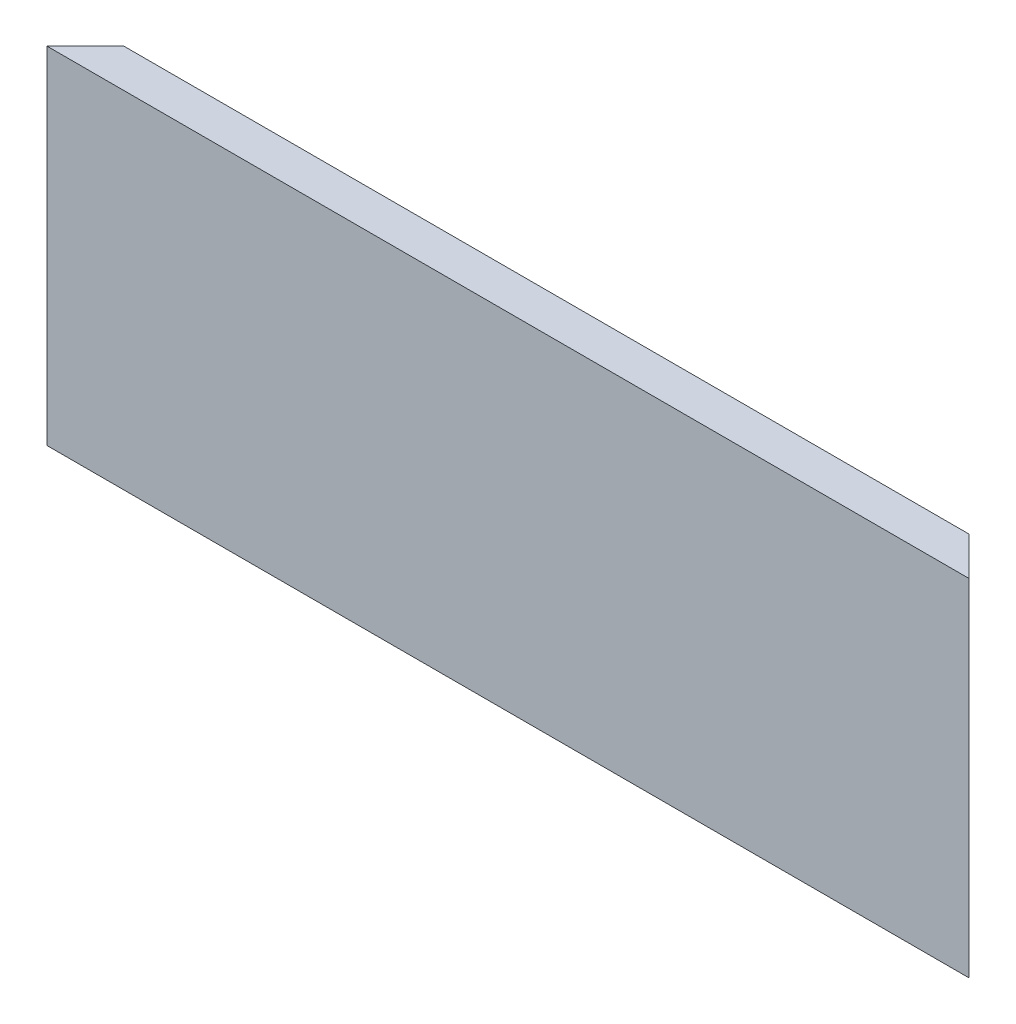
ISO-10303-21;
HEADER;
FILE_DESCRIPTION(('STEP AP214'),'2;1');
FILE_NAME('part.step','',(''),(''),'','','');
FILE_SCHEMA(('AUTOMOTIVE_DESIGN { 1 0 10303 214 1 1 1 1 }'));
ENDSEC;
DATA;
#1=APPLICATION_CONTEXT('core data for automotive mechanical design processes');
#2=APPLICATION_PROTOCOL_DEFINITION('international standard','automotive_design',2000,#1);
#3=PRODUCT_CONTEXT('',#1,'mechanical');
#4=PRODUCT('Part','Part','',(#3));
#5=PRODUCT_RELATED_PRODUCT_CATEGORY('part','',(#4));
#6=PRODUCT_DEFINITION_FORMATION('','',#4);
#7=PRODUCT_DEFINITION_CONTEXT('part definition',#1,'design');
#8=PRODUCT_DEFINITION('design','',#6,#7);
#9=PRODUCT_DEFINITION_SHAPE('','',#8);
#10=(LENGTH_UNIT() NAMED_UNIT(*) SI_UNIT(.MILLI.,.METRE.));
#11=(NAMED_UNIT(*) PLANE_ANGLE_UNIT() SI_UNIT($,.RADIAN.));
#12=(NAMED_UNIT(*) SI_UNIT($,.STERADIAN.) SOLID_ANGLE_UNIT());
#13=UNCERTAINTY_MEASURE_WITH_UNIT(LENGTH_MEASURE(1.E-05),#10,'distance_accuracy_value','');
#14=(GEOMETRIC_REPRESENTATION_CONTEXT(3) GLOBAL_UNCERTAINTY_ASSIGNED_CONTEXT((#13)) GLOBAL_UNIT_ASSIGNED_CONTEXT((#10,
#11,#12)) REPRESENTATION_CONTEXT('',''));
#15=CARTESIAN_POINT('',(0.,0.,0.));
#16=DIRECTION('',(0.,0.,1.));
#17=DIRECTION('',(1.,0.,0.));
#18=AXIS2_PLACEMENT_3D('',#15,#16,#17);
#19=CARTESIAN_POINT('',(0.,0.,-6.35));
#20=DIRECTION('',(0.,0.,-1.));
#21=DIRECTION('',(-1.,0.,0.));
#22=AXIS2_PLACEMENT_3D('',#19,#20,#21);
#23=PLANE('',#22);
#24=DIRECTION('',(0.,1.,0.));
#25=VECTOR('',#24,1.);
#26=CARTESIAN_POINT('',(146.05,0.,-6.35));
#27=LINE('',#26,#25);
#28=CARTESIAN_POINT('',(146.05,8.0137,-6.35));
#29=VERTEX_POINT('',#28);
#30=CARTESIAN_POINT('',(146.05,41.5925,-6.35));
#31=VERTEX_POINT('',#30);
#32=EDGE_CURVE('E146',#29,#31,#27,.T.);
#33=ORIENTED_EDGE('',*,*,#32,.F.);
#34=DIRECTION('',(-1.,0.,0.));
#35=VECTOR('',#34,1.);
#36=CARTESIAN_POINT('',(152.4,8.0137,-6.35));
#37=LINE('',#36,#35);
#38=CARTESIAN_POINT('',(6.34999999999993,8.0137,-6.35000000000001));
#39=VERTEX_POINT('',#38);
#40=EDGE_CURVE('E186',#29,#39,#37,.T.);
#41=ORIENTED_EDGE('',*,*,#40,.T.);
#42=DIRECTION('',(0.,1.,0.));
#43=VECTOR('',#42,1.);
#44=CARTESIAN_POINT('',(6.34999999999991,0.,-6.35));
#45=LINE('',#44,#43);
#46=CARTESIAN_POINT('',(6.34999999999993,41.5925,-6.35000000000001));
#47=VERTEX_POINT('',#46);
#48=EDGE_CURVE('E246',#39,#47,#45,.T.);
#49=ORIENTED_EDGE('',*,*,#48,.T.);
#50=DIRECTION('',(-1.,0.,0.));
#51=VECTOR('',#50,1.);
#52=CARTESIAN_POINT('',(152.4,41.5925,-6.35));
#53=LINE('',#52,#51);
#54=EDGE_CURVE('E177',#31,#47,#53,.T.);
#55=ORIENTED_EDGE('',*,*,#54,.F.);
#56=EDGE_LOOP('',(#33,#41,#49,#55));
#57=FACE_BOUND('',#56,.T.);
#58=ADVANCED_FACE('F34',(#57),#23,.T.);
#59=CARTESIAN_POINT('',(6.34999999999991,0.,-6.35));
#60=VERTEX_POINT('',#59);
#61=CARTESIAN_POINT('',(6.34999999999993,4.7625,-6.35000000000001));
#62=VERTEX_POINT('',#61);
#63=EDGE_CURVE('E138',#60,#62,#45,.T.);
#64=ORIENTED_EDGE('',*,*,#63,.T.);
#65=DIRECTION('',(-1.,0.,0.));
#66=VECTOR('',#65,1.);
#67=CARTESIAN_POINT('',(152.4,4.7625,-6.35));
#68=LINE('',#67,#66);
#69=CARTESIAN_POINT('',(146.05,4.7625,-6.35));
#70=VERTEX_POINT('',#69);
#71=EDGE_CURVE('E124',#70,#62,#68,.T.);
#72=ORIENTED_EDGE('',*,*,#71,.F.);
#73=CARTESIAN_POINT('',(146.05,0.,-6.35));
#74=VERTEX_POINT('',#73);
#75=EDGE_CURVE('E136',#74,#70,#27,.T.);
#76=ORIENTED_EDGE('',*,*,#75,.F.);
#77=DIRECTION('',(1.,0.,0.));
#78=VECTOR('',#77,1.);
#79=CARTESIAN_POINT('',(0.,0.,-6.35));
#80=LINE('',#79,#78);
#81=EDGE_CURVE('E221',#60,#74,#80,.T.);
#82=ORIENTED_EDGE('',*,*,#81,.F.);
#83=EDGE_LOOP('',(#64,#72,#76,#82));
#84=FACE_BOUND('',#83,.T.);
#85=ADVANCED_FACE('F134',(#84),#23,.T.);
#86=CARTESIAN_POINT('',(0.,0.,0.));
#87=DIRECTION('',(0.707106781186552,0.,0.707106781186543));
#88=DIRECTION('',(0.707106781186543,0.,-0.707106781186552));
#89=AXIS2_PLACEMENT_3D('',#86,#87,#88);
#90=PLANE('',#89);
#91=DIRECTION('',(0.707106781186543,0.,-0.707106781186552));
#92=VECTOR('',#91,1.);
#93=CARTESIAN_POINT('',(0.,8.0137,0.));
#94=LINE('',#93,#92);
#95=CARTESIAN_POINT('',(3.17500000000001,8.0137,-3.175));
#96=VERTEX_POINT('',#95);
#97=EDGE_CURVE('E180',#96,#39,#94,.T.);
#98=ORIENTED_EDGE('',*,*,#97,.F.);
#99=DIRECTION('',(0.,1.,0.));
#100=VECTOR('',#99,1.);
#101=CARTESIAN_POINT('',(3.17499999999996,0.,-3.175));
#102=LINE('',#101,#100);
#103=CARTESIAN_POINT('',(3.175,4.7625,-3.17500000000001));
#104=VERTEX_POINT('',#103);
#105=EDGE_CURVE('E182',#104,#96,#102,.T.);
#106=ORIENTED_EDGE('',*,*,#105,.F.);
#107=DIRECTION('',(-0.707106781186543,0.,0.707106781186552));
#108=VECTOR('',#107,1.);
#109=CARTESIAN_POINT('',(0.,4.7625,0.));
#110=LINE('',#109,#108);
#111=EDGE_CURVE('E184',#62,#104,#110,.T.);
#112=ORIENTED_EDGE('',*,*,#111,.F.);
#113=ORIENTED_EDGE('',*,*,#63,.F.);
#114=DIRECTION('',(0.707106781186542,0.,-0.707106781186552));
#115=VECTOR('',#114,1.);
#116=CARTESIAN_POINT('',(0.,0.,0.));
#117=LINE('',#116,#115);
#118=CARTESIAN_POINT('',(0.,0.,0.));
#119=VERTEX_POINT('',#118);
#120=EDGE_CURVE('E282',#119,#60,#117,.T.);
#121=ORIENTED_EDGE('',*,*,#120,.F.);
#122=DIRECTION('',(0.,-1.,0.));
#123=VECTOR('',#122,1.);
#124=CARTESIAN_POINT('',(0.,0.,0.));
#125=LINE('',#124,#123);
#126=CARTESIAN_POINT('',(0.,57.15,0.));
#127=VERTEX_POINT('',#126);
#128=EDGE_CURVE('E145',#127,#119,#125,.T.);
#129=ORIENTED_EDGE('',*,*,#128,.F.);
#130=DIRECTION('',(0.707106781186542,0.,-0.707106781186552));
#131=VECTOR('',#130,1.);
#132=CARTESIAN_POINT('',(0.,57.15,0.));
#133=LINE('',#132,#131);
#134=CARTESIAN_POINT('',(6.34999999999991,57.15,-6.35));
#135=VERTEX_POINT('',#134);
#136=EDGE_CURVE('E165',#127,#135,#133,.T.);
#137=ORIENTED_EDGE('',*,*,#136,.T.);
#138=CARTESIAN_POINT('',(6.34999999999993,46.355,-6.35000000000001));
#139=VERTEX_POINT('',#138);
#140=EDGE_CURVE('E216',#139,#135,#45,.T.);
#141=ORIENTED_EDGE('',*,*,#140,.F.);
#142=DIRECTION('',(0.707106781186543,0.,-0.707106781186552));
#143=VECTOR('',#142,1.);
#144=CARTESIAN_POINT('',(0.,46.355,0.));
#145=LINE('',#144,#143);
#146=CARTESIAN_POINT('',(3.17500000000001,46.355,-3.175));
#147=VERTEX_POINT('',#146);
#148=EDGE_CURVE('E163',#147,#139,#145,.T.);
#149=ORIENTED_EDGE('',*,*,#148,.F.);
#150=DIRECTION('',(0.,1.,0.));
#151=VECTOR('',#150,1.);
#152=CARTESIAN_POINT('',(3.17499999999996,0.,-3.175));
#153=LINE('',#152,#151);
#154=CARTESIAN_POINT('',(3.175,41.5925,-3.17500000000001));
#155=VERTEX_POINT('',#154);
#156=EDGE_CURVE('E166',#155,#147,#153,.T.);
#157=ORIENTED_EDGE('',*,*,#156,.F.);
#158=DIRECTION('',(-0.707106781186543,0.,0.707106781186552));
#159=VECTOR('',#158,1.);
#160=CARTESIAN_POINT('',(0.,41.5925,0.));
#161=LINE('',#160,#159);
#162=EDGE_CURVE('E168',#47,#155,#161,.T.);
#163=ORIENTED_EDGE('',*,*,#162,.F.);
#164=ORIENTED_EDGE('',*,*,#48,.F.);
#165=EDGE_LOOP('',(#98,#106,#112,#113,#121,#129,#137,#141,#149,#157,#163,#164));
#166=FACE_BOUND('',#165,.T.);
#167=ADVANCED_FACE('F252',(#166),#90,.F.);
#168=CARTESIAN_POINT('',(152.4,0.,0.));
#169=DIRECTION('',(-0.707106781186543,0.,0.707106781186552));
#170=DIRECTION('',(0.707106781186552,0.,0.707106781186543));
#171=AXIS2_PLACEMENT_3D('',#168,#169,#170);
#172=PLANE('',#171);
#173=DIRECTION('',(0.707106781186552,0.,0.707106781186543));
#174=VECTOR('',#173,1.);
#175=CARTESIAN_POINT('',(152.4,8.0137,0.));
#176=LINE('',#175,#174);
#177=CARTESIAN_POINT('',(149.225,8.0137,-3.175));
#178=VERTEX_POINT('',#177);
#179=EDGE_CURVE('E11',#29,#178,#176,.T.);
#180=ORIENTED_EDGE('',*,*,#179,.F.);
#181=ORIENTED_EDGE('',*,*,#32,.T.);
#182=DIRECTION('',(-0.707106781186552,0.,-0.707106781186543));
#183=VECTOR('',#182,1.);
#184=CARTESIAN_POINT('',(152.4,41.5925,0.));
#185=LINE('',#184,#183);
#186=CARTESIAN_POINT('',(149.225,41.5925,-3.175));
#187=VERTEX_POINT('',#186);
#188=EDGE_CURVE('E220',#187,#31,#185,.T.);
#189=ORIENTED_EDGE('',*,*,#188,.F.);
#190=DIRECTION('',(0.,-1.,0.));
#191=VECTOR('',#190,1.);
#192=CARTESIAN_POINT('',(149.225,0.,-3.175));
#193=LINE('',#192,#191);
#194=CARTESIAN_POINT('',(149.225,46.355,-3.175));
#195=VERTEX_POINT('',#194);
#196=EDGE_CURVE('E223',#195,#187,#193,.T.);
#197=ORIENTED_EDGE('',*,*,#196,.F.);
#198=DIRECTION('',(0.707106781186552,0.,0.707106781186543));
#199=VECTOR('',#198,1.);
#200=CARTESIAN_POINT('',(152.4,46.355,0.));
#201=LINE('',#200,#199);
#202=CARTESIAN_POINT('',(146.05,46.355,-6.35));
#203=VERTEX_POINT('',#202);
#204=EDGE_CURVE('E129',#203,#195,#201,.T.);
#205=ORIENTED_EDGE('',*,*,#204,.F.);
#206=CARTESIAN_POINT('',(146.05,57.15,-6.35));
#207=VERTEX_POINT('',#206);
#208=EDGE_CURVE('E148',#203,#207,#27,.T.);
#209=ORIENTED_EDGE('',*,*,#208,.T.);
#210=DIRECTION('',(0.707106781186552,0.,0.707106781186543));
#211=VECTOR('',#210,1.);
#212=CARTESIAN_POINT('',(152.4,57.15,0.));
#213=LINE('',#212,#211);
#214=CARTESIAN_POINT('',(152.4,57.15,0.));
#215=VERTEX_POINT('',#214);
#216=EDGE_CURVE('E157',#207,#215,#213,.T.);
#217=ORIENTED_EDGE('',*,*,#216,.T.);
#218=DIRECTION('',(0.,1.,0.));
#219=VECTOR('',#218,1.);
#220=CARTESIAN_POINT('',(152.4,0.,0.));
#221=LINE('',#220,#219);
#222=CARTESIAN_POINT('',(152.4,0.,0.));
#223=VERTEX_POINT('',#222);
#224=EDGE_CURVE('E230',#223,#215,#221,.T.);
#225=ORIENTED_EDGE('',*,*,#224,.F.);
#226=DIRECTION('',(0.707106781186552,0.,0.707106781186543));
#227=VECTOR('',#226,1.);
#228=CARTESIAN_POINT('',(152.4,0.,0.));
#229=LINE('',#228,#227);
#230=EDGE_CURVE('E144',#74,#223,#229,.T.);
#231=ORIENTED_EDGE('',*,*,#230,.F.);
#232=ORIENTED_EDGE('',*,*,#75,.T.);
#233=DIRECTION('',(-0.707106781186552,0.,-0.707106781186543));
#234=VECTOR('',#233,1.);
#235=CARTESIAN_POINT('',(152.4,4.7625,0.));
#236=LINE('',#235,#234);
#237=CARTESIAN_POINT('',(149.225,4.7625,-3.175));
#238=VERTEX_POINT('',#237);
#239=EDGE_CURVE('E121',#238,#70,#236,.T.);
#240=ORIENTED_EDGE('',*,*,#239,.F.);
#241=DIRECTION('',(0.,-1.,0.));
#242=VECTOR('',#241,1.);
#243=CARTESIAN_POINT('',(149.225,0.,-3.175));
#244=LINE('',#243,#242);
#245=EDGE_CURVE('E42',#178,#238,#244,.T.);
#246=ORIENTED_EDGE('',*,*,#245,.F.);
#247=EDGE_LOOP('',(#180,#181,#189,#197,#205,#209,#217,#225,#231,#232,#240,#246));
#248=FACE_BOUND('',#247,.T.);
#249=ADVANCED_FACE('F142',(#248),#172,.F.);
#250=CARTESIAN_POINT('',(142.748,49.911,-6.35));
#251=DIRECTION('',(0.,0.,-1.));
#252=DIRECTION('',(-1.,0.,0.));
#253=AXIS2_PLACEMENT_3D('',#250,#251,#252);
#254=CIRCLE('',#253,2.38125);
#255=CARTESIAN_POINT('',(140.36675,49.911,-6.35));
#256=VERTEX_POINT('',#255);
#257=EDGE_CURVE('E193',#256,#256,#254,.T.);
#258=ORIENTED_EDGE('',*,*,#257,.F.);
#259=EDGE_LOOP('',(#258));
#260=FACE_BOUND('',#259,.T.);
#261=ORIENTED_EDGE('',*,*,#208,.F.);
#262=DIRECTION('',(-1.,0.,0.));
#263=VECTOR('',#262,1.);
#264=CARTESIAN_POINT('',(152.4,46.355,-6.35));
#265=LINE('',#264,#263);
#266=EDGE_CURVE('E170',#203,#139,#265,.T.);
#267=ORIENTED_EDGE('',*,*,#266,.T.);
#268=ORIENTED_EDGE('',*,*,#140,.T.);
#269=DIRECTION('',(-1.,0.,0.));
#270=VECTOR('',#269,1.);
#271=CARTESIAN_POINT('',(0.,57.15,-6.35));
#272=LINE('',#271,#270);
#273=EDGE_CURVE('E215',#207,#135,#272,.T.);
#274=ORIENTED_EDGE('',*,*,#273,.F.);
#275=EDGE_LOOP('',(#261,#267,#268,#274));
#276=FACE_BOUND('',#275,.T.);
#277=ADVANCED_FACE('F207',(#260,#276),#23,.T.);
#278=CARTESIAN_POINT('',(0.,57.15,-6.35));
#279=DIRECTION('',(0.,1.,0.));
#280=DIRECTION('',(0.,0.,1.));
#281=AXIS2_PLACEMENT_3D('',#278,#279,#280);
#282=PLANE('',#281);
#283=ORIENTED_EDGE('',*,*,#216,.F.);
#284=ORIENTED_EDGE('',*,*,#273,.T.);
#285=ORIENTED_EDGE('',*,*,#136,.F.);
#286=DIRECTION('',(-1.,0.,0.));
#287=VECTOR('',#286,1.);
#288=CARTESIAN_POINT('',(0.,57.15,0.));
#289=LINE('',#288,#287);
#290=EDGE_CURVE('E225',#215,#127,#289,.T.);
#291=ORIENTED_EDGE('',*,*,#290,.F.);
#292=EDGE_LOOP('',(#283,#284,#285,#291));
#293=FACE_BOUND('',#292,.T.);
#294=ADVANCED_FACE('F210',(#293),#282,.T.);
#295=CARTESIAN_POINT('',(0.,0.,-6.35));
#296=DIRECTION('',(0.,-1.,0.));
#297=DIRECTION('',(0.,0.,-1.));
#298=AXIS2_PLACEMENT_3D('',#295,#296,#297);
#299=PLANE('',#298);
#300=ORIENTED_EDGE('',*,*,#230,.T.);
#301=DIRECTION('',(1.,0.,0.));
#302=VECTOR('',#301,1.);
#303=CARTESIAN_POINT('',(0.,0.,0.));
#304=LINE('',#303,#302);
#305=EDGE_CURVE('E150',#119,#223,#304,.T.);
#306=ORIENTED_EDGE('',*,*,#305,.F.);
#307=ORIENTED_EDGE('',*,*,#120,.T.);
#308=ORIENTED_EDGE('',*,*,#81,.T.);
#309=EDGE_LOOP('',(#300,#306,#307,#308));
#310=FACE_BOUND('',#309,.T.);
#311=ADVANCED_FACE('F36',(#310),#299,.T.);
#312=CARTESIAN_POINT('',(0.,0.,0.));
#313=DIRECTION('',(0.,0.,-1.));
#314=DIRECTION('',(-1.,0.,0.));
#315=AXIS2_PLACEMENT_3D('',#312,#313,#314);
#316=PLANE('',#315);
#317=ORIENTED_EDGE('',*,*,#128,.T.);
#318=ORIENTED_EDGE('',*,*,#305,.T.);
#319=ORIENTED_EDGE('',*,*,#224,.T.);
#320=ORIENTED_EDGE('',*,*,#290,.T.);
#321=EDGE_LOOP('',(#317,#318,#319,#320));
#322=FACE_BOUND('',#321,.T.);
#323=ADVANCED_FACE('F261',(#322),#316,.F.);
#324=CARTESIAN_POINT('',(152.4,46.355,-6.35));
#325=DIRECTION('',(0.,-1.,0.));
#326=DIRECTION('',(0.,0.,-1.));
#327=AXIS2_PLACEMENT_3D('',#324,#325,#326);
#328=PLANE('',#327);
#329=ORIENTED_EDGE('',*,*,#148,.T.);
#330=ORIENTED_EDGE('',*,*,#266,.F.);
#331=ORIENTED_EDGE('',*,*,#204,.T.);
#332=DIRECTION('',(-1.,0.,0.));
#333=VECTOR('',#332,1.);
#334=CARTESIAN_POINT('',(152.4,46.355,-3.175));
#335=LINE('',#334,#333);
#336=EDGE_CURVE('E173',#195,#147,#335,.T.);
#337=ORIENTED_EDGE('',*,*,#336,.T.);
#338=EDGE_LOOP('',(#329,#330,#331,#337));
#339=FACE_BOUND('',#338,.T.);
#340=ADVANCED_FACE('F259',(#339),#328,.T.);
#341=CARTESIAN_POINT('',(152.4,46.355,-3.175));
#342=DIRECTION('',(0.,0.,-1.));
#343=DIRECTION('',(0.,1.,0.));
#344=AXIS2_PLACEMENT_3D('',#341,#342,#343);
#345=PLANE('',#344);
#346=ORIENTED_EDGE('',*,*,#156,.T.);
#347=ORIENTED_EDGE('',*,*,#336,.F.);
#348=ORIENTED_EDGE('',*,*,#196,.T.);
#349=DIRECTION('',(-1.,0.,0.));
#350=VECTOR('',#349,1.);
#351=CARTESIAN_POINT('',(152.4,41.5925,-3.175));
#352=LINE('',#351,#350);
#353=EDGE_CURVE('E57',#187,#155,#352,.T.);
#354=ORIENTED_EDGE('',*,*,#353,.T.);
#355=EDGE_LOOP('',(#346,#347,#348,#354));
#356=FACE_BOUND('',#355,.T.);
#357=ADVANCED_FACE('F256',(#356),#345,.T.);
#358=CARTESIAN_POINT('',(152.4,41.5925,-3.175));
#359=DIRECTION('',(0.,1.,0.));
#360=DIRECTION('',(0.,0.,1.));
#361=AXIS2_PLACEMENT_3D('',#358,#359,#360);
#362=PLANE('',#361);
#363=ORIENTED_EDGE('',*,*,#162,.T.);
#364=ORIENTED_EDGE('',*,*,#353,.F.);
#365=ORIENTED_EDGE('',*,*,#188,.T.);
#366=ORIENTED_EDGE('',*,*,#54,.T.);
#367=EDGE_LOOP('',(#363,#364,#365,#366));
#368=FACE_BOUND('',#367,.T.);
#369=ADVANCED_FACE('F248',(#368),#362,.T.);
#370=CARTESIAN_POINT('',(152.4,8.0137,-3.175));
#371=DIRECTION('',(0.,-1.,0.));
#372=DIRECTION('',(0.,0.,-1.));
#373=AXIS2_PLACEMENT_3D('',#370,#371,#372);
#374=PLANE('',#373);
#375=ORIENTED_EDGE('',*,*,#97,.T.);
#376=ORIENTED_EDGE('',*,*,#40,.F.);
#377=ORIENTED_EDGE('',*,*,#179,.T.);
#378=DIRECTION('',(-1.,0.,0.));
#379=VECTOR('',#378,1.);
#380=CARTESIAN_POINT('',(152.4,8.0137,-3.175));
#381=LINE('',#380,#379);
#382=EDGE_CURVE('E189',#178,#96,#381,.T.);
#383=ORIENTED_EDGE('',*,*,#382,.T.);
#384=EDGE_LOOP('',(#375,#376,#377,#383));
#385=FACE_BOUND('',#384,.T.);
#386=ADVANCED_FACE('F284',(#385),#374,.T.);
#387=CARTESIAN_POINT('',(152.4,4.7625,-3.175));
#388=DIRECTION('',(0.,0.,-1.));
#389=DIRECTION('',(-1.,0.,0.));
#390=AXIS2_PLACEMENT_3D('',#387,#388,#389);
#391=PLANE('',#390);
#392=ORIENTED_EDGE('',*,*,#105,.T.);
#393=ORIENTED_EDGE('',*,*,#382,.F.);
#394=ORIENTED_EDGE('',*,*,#245,.T.);
#395=DIRECTION('',(-1.,0.,0.));
#396=VECTOR('',#395,1.);
#397=CARTESIAN_POINT('',(152.4,4.7625,-3.175));
#398=LINE('',#397,#396);
#399=EDGE_CURVE('E49',#238,#104,#398,.T.);
#400=ORIENTED_EDGE('',*,*,#399,.T.);
#401=EDGE_LOOP('',(#392,#393,#394,#400));
#402=FACE_BOUND('',#401,.T.);
#403=ADVANCED_FACE('F238',(#402),#391,.T.);
#404=CARTESIAN_POINT('',(152.4,4.7625,-6.35));
#405=DIRECTION('',(0.,1.,0.));
#406=DIRECTION('',(0.,0.,1.));
#407=AXIS2_PLACEMENT_3D('',#404,#405,#406);
#408=PLANE('',#407);
#409=ORIENTED_EDGE('',*,*,#111,.T.);
#410=ORIENTED_EDGE('',*,*,#399,.F.);
#411=ORIENTED_EDGE('',*,*,#239,.T.);
#412=ORIENTED_EDGE('',*,*,#71,.T.);
#413=EDGE_LOOP('',(#409,#410,#411,#412));
#414=FACE_BOUND('',#413,.T.);
#415=ADVANCED_FACE('F123',(#414),#408,.T.);
#416=CARTESIAN_POINT('',(142.748,49.911,-1.27));
#417=DIRECTION('',(0.,0.,-1.));
#418=DIRECTION('',(-1.,0.,0.));
#419=AXIS2_PLACEMENT_3D('',#416,#417,#418);
#420=CYLINDRICAL_SURFACE('',#419,2.38125);
#421=CARTESIAN_POINT('',(142.748,49.911,-1.27));
#422=DIRECTION('',(0.,0.,-1.));
#423=DIRECTION('',(-1.,0.,0.));
#424=AXIS2_PLACEMENT_3D('',#421,#422,#423);
#425=CIRCLE('',#424,2.38125);
#426=CARTESIAN_POINT('',(140.36675,49.911,-1.27));
#427=VERTEX_POINT('',#426);
#428=EDGE_CURVE('E139',#427,#427,#425,.T.);
#429=ORIENTED_EDGE('',*,*,#428,.F.);
#430=EDGE_LOOP('',(#429));
#431=FACE_BOUND('',#430,.T.);
#432=ORIENTED_EDGE('',*,*,#257,.T.);
#433=EDGE_LOOP('',(#432));
#434=FACE_BOUND('',#433,.T.);
#435=ADVANCED_FACE('F201',(#431,#434),#420,.F.);
#436=CARTESIAN_POINT('',(142.748,49.911,-1.27));
#437=DIRECTION('',(0.,0.,-1.));
#438=DIRECTION('',(-1.,0.,0.));
#439=AXIS2_PLACEMENT_3D('',#436,#437,#438);
#440=PLANE('',#439);
#441=ORIENTED_EDGE('',*,*,#428,.T.);
#442=EDGE_LOOP('',(#441));
#443=FACE_BOUND('',#442,.T.);
#444=ADVANCED_FACE('F199',(#443),#440,.T.);
#445=CLOSED_SHELL('',(#58,#85,#167,#249,#277,#294,#311,#323,#340,#357,#369,#386,#403,#415,#435,#444));
#446=MANIFOLD_SOLID_BREP('B2',#445);
#447=ADVANCED_BREP_SHAPE_REPRESENTATION('',(#18,#446),#14);
#448=SHAPE_DEFINITION_REPRESENTATION(#9,#447);
ENDSEC;
END-ISO-10303-21;
